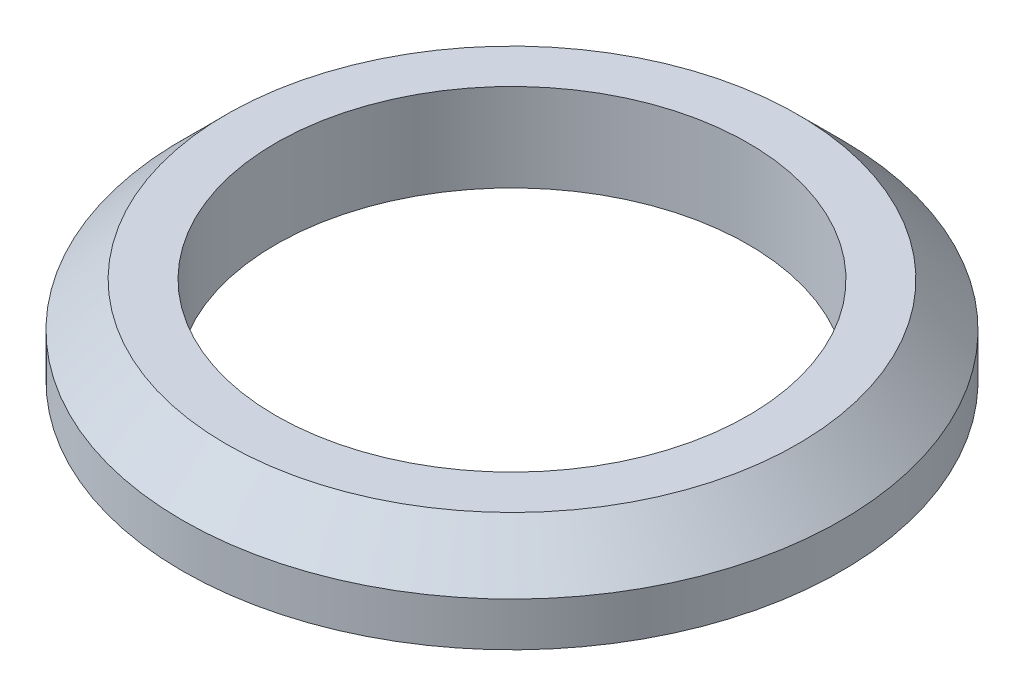
ISO-10303-21;
HEADER;
FILE_DESCRIPTION(('STEP AP214'),'2;1');
FILE_NAME('part.step','',(''),(''),'','','');
FILE_SCHEMA(('AUTOMOTIVE_DESIGN { 1 0 10303 214 1 1 1 1 }'));
ENDSEC;
DATA;
#1=APPLICATION_CONTEXT('core data for automotive mechanical design processes');
#2=APPLICATION_PROTOCOL_DEFINITION('international standard','automotive_design',2000,#1);
#3=PRODUCT_CONTEXT('',#1,'mechanical');
#4=PRODUCT('Part','Part','',(#3));
#5=PRODUCT_RELATED_PRODUCT_CATEGORY('part','',(#4));
#6=PRODUCT_DEFINITION_FORMATION('','',#4);
#7=PRODUCT_DEFINITION_CONTEXT('part definition',#1,'design');
#8=PRODUCT_DEFINITION('design','',#6,#7);
#9=PRODUCT_DEFINITION_SHAPE('','',#8);
#10=(LENGTH_UNIT() NAMED_UNIT(*) SI_UNIT(.MILLI.,.METRE.));
#11=(NAMED_UNIT(*) PLANE_ANGLE_UNIT() SI_UNIT($,.RADIAN.));
#12=(NAMED_UNIT(*) SI_UNIT($,.STERADIAN.) SOLID_ANGLE_UNIT());
#13=UNCERTAINTY_MEASURE_WITH_UNIT(LENGTH_MEASURE(1.E-05),#10,'distance_accuracy_value','');
#14=(GEOMETRIC_REPRESENTATION_CONTEXT(3) GLOBAL_UNCERTAINTY_ASSIGNED_CONTEXT((#13)) GLOBAL_UNIT_ASSIGNED_CONTEXT((#10,
#11,#12)) REPRESENTATION_CONTEXT('',''));
#15=CARTESIAN_POINT('',(0.,0.,0.));
#16=DIRECTION('',(0.,0.,1.));
#17=DIRECTION('',(1.,0.,0.));
#18=AXIS2_PLACEMENT_3D('',#15,#16,#17);
#19=CARTESIAN_POINT('',(0.,0.8,0.));
#20=DIRECTION('',(0.,1.,0.));
#21=DIRECTION('',(0.,0.,1.));
#22=AXIS2_PLACEMENT_3D('',#19,#20,#21);
#23=PLANE('',#22);
#24=CARTESIAN_POINT('',(0.,0.8,0.));
#25=DIRECTION('',(0.,1.,0.));
#26=DIRECTION('',(0.,0.,1.));
#27=AXIS2_PLACEMENT_3D('',#24,#25,#26);
#28=CIRCLE('',#27,2.6);
#29=CARTESIAN_POINT('',(0.,0.8,2.6));
#30=VERTEX_POINT('',#29);
#31=EDGE_CURVE('E45',#30,#30,#28,.T.);
#32=ORIENTED_EDGE('',*,*,#31,.T.);
#33=EDGE_LOOP('',(#32));
#34=FACE_BOUND('',#33,.T.);
#35=CARTESIAN_POINT('',(0.,0.8,0.));
#36=DIRECTION('',(0.,1.,0.));
#37=DIRECTION('',(0.,0.,1.));
#38=AXIS2_PLACEMENT_3D('',#35,#36,#37);
#39=CIRCLE('',#38,2.15);
#40=CARTESIAN_POINT('',(0.,0.8,2.15));
#41=VERTEX_POINT('',#40);
#42=EDGE_CURVE('E53',#41,#41,#39,.T.);
#43=ORIENTED_EDGE('',*,*,#42,.F.);
#44=EDGE_LOOP('',(#43));
#45=FACE_BOUND('',#44,.T.);
#46=ADVANCED_FACE('F37',(#34,#45),#23,.T.);
#47=CARTESIAN_POINT('',(0.,0.,0.));
#48=DIRECTION('',(0.,1.,0.));
#49=DIRECTION('',(0.,0.,1.));
#50=AXIS2_PLACEMENT_3D('',#47,#48,#49);
#51=PLANE('',#50);
#52=CARTESIAN_POINT('',(0.,0.,0.));
#53=DIRECTION('',(0.,1.,0.));
#54=DIRECTION('',(0.,0.,1.));
#55=AXIS2_PLACEMENT_3D('',#52,#53,#54);
#56=CIRCLE('',#55,3.);
#57=CARTESIAN_POINT('',(0.,0.,3.));
#58=VERTEX_POINT('',#57);
#59=EDGE_CURVE('E49',#58,#58,#56,.T.);
#60=ORIENTED_EDGE('',*,*,#59,.F.);
#61=EDGE_LOOP('',(#60));
#62=FACE_BOUND('',#61,.T.);
#63=CARTESIAN_POINT('',(0.,0.,0.));
#64=DIRECTION('',(0.,1.,0.));
#65=DIRECTION('',(0.,0.,1.));
#66=AXIS2_PLACEMENT_3D('',#63,#64,#65);
#67=CIRCLE('',#66,2.15);
#68=CARTESIAN_POINT('',(0.,0.,2.15));
#69=VERTEX_POINT('',#68);
#70=EDGE_CURVE('E56',#69,#69,#67,.T.);
#71=ORIENTED_EDGE('',*,*,#70,.T.);
#72=EDGE_LOOP('',(#71));
#73=FACE_BOUND('',#72,.T.);
#74=ADVANCED_FACE('F66',(#62,#73),#51,.F.);
#75=CARTESIAN_POINT('',(0.,0.8,0.));
#76=DIRECTION('',(0.,-1.,0.));
#77=DIRECTION('',(0.,0.,-1.));
#78=AXIS2_PLACEMENT_3D('',#75,#76,#77);
#79=CYLINDRICAL_SURFACE('',#78,3.);
#80=CARTESIAN_POINT('',(0.,0.399999999999999,0.));
#81=DIRECTION('',(0.,1.,0.));
#82=DIRECTION('',(0.,0.,1.));
#83=AXIS2_PLACEMENT_3D('',#80,#81,#82);
#84=CIRCLE('',#83,3.);
#85=CARTESIAN_POINT('',(0.,0.399999999999999,3.));
#86=VERTEX_POINT('',#85);
#87=EDGE_CURVE('E10',#86,#86,#84,.F.);
#88=ORIENTED_EDGE('',*,*,#87,.T.);
#89=EDGE_LOOP('',(#88));
#90=FACE_BOUND('',#89,.T.);
#91=ORIENTED_EDGE('',*,*,#59,.T.);
#92=EDGE_LOOP('',(#91));
#93=FACE_BOUND('',#92,.T.);
#94=ADVANCED_FACE('F71',(#90,#93),#79,.T.);
#95=CARTESIAN_POINT('',(0.,0.8,0.));
#96=DIRECTION('',(0.,-1.,0.));
#97=DIRECTION('',(0.,0.,-1.));
#98=AXIS2_PLACEMENT_3D('',#95,#96,#97);
#99=CYLINDRICAL_SURFACE('',#98,2.15);
#100=ORIENTED_EDGE('',*,*,#42,.T.);
#101=EDGE_LOOP('',(#100));
#102=FACE_BOUND('',#101,.T.);
#103=ORIENTED_EDGE('',*,*,#70,.F.);
#104=EDGE_LOOP('',(#103));
#105=FACE_BOUND('',#104,.T.);
#106=ADVANCED_FACE('F62',(#102,#105),#99,.F.);
#107=CARTESIAN_POINT('',(0.,0.8,0.));
#108=DIRECTION('',(0.,-1.,0.));
#109=DIRECTION('',(0.,0.,-1.));
#110=AXIS2_PLACEMENT_3D('',#107,#108,#109);
#111=CONICAL_SURFACE('',#110,2.6,0.785398163397446);
#112=ORIENTED_EDGE('',*,*,#87,.F.);
#113=EDGE_LOOP('',(#112));
#114=FACE_BOUND('',#113,.T.);
#115=ORIENTED_EDGE('',*,*,#31,.F.);
#116=EDGE_LOOP('',(#115));
#117=FACE_BOUND('',#116,.T.);
#118=ADVANCED_FACE('F40',(#114,#117),#111,.T.);
#119=CLOSED_SHELL('',(#46,#74,#94,#106,#118));
#120=MANIFOLD_SOLID_BREP('B2',#119);
#121=ADVANCED_BREP_SHAPE_REPRESENTATION('',(#18,#120),#14);
#122=SHAPE_DEFINITION_REPRESENTATION(#9,#121);
ENDSEC;
END-ISO-10303-21;
